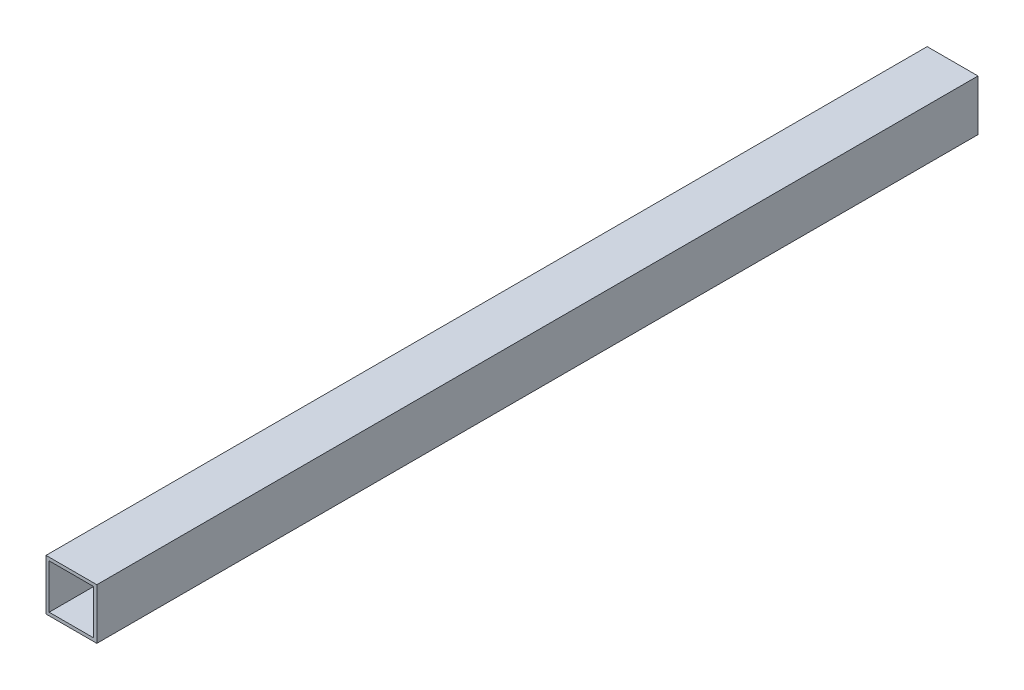
ISO-10303-21;
HEADER;
FILE_DESCRIPTION(('STEP AP214'),'2;1');
FILE_NAME('part.step','',(''),(''),'','','');
FILE_SCHEMA(('AUTOMOTIVE_DESIGN { 1 0 10303 214 1 1 1 1 }'));
ENDSEC;
DATA;
#1=APPLICATION_CONTEXT('core data for automotive mechanical design processes');
#2=APPLICATION_PROTOCOL_DEFINITION('international standard','automotive_design',2000,#1);
#3=PRODUCT_CONTEXT('',#1,'mechanical');
#4=PRODUCT('Part','Part','',(#3));
#5=PRODUCT_RELATED_PRODUCT_CATEGORY('part','',(#4));
#6=PRODUCT_DEFINITION_FORMATION('','',#4);
#7=PRODUCT_DEFINITION_CONTEXT('part definition',#1,'design');
#8=PRODUCT_DEFINITION('design','',#6,#7);
#9=PRODUCT_DEFINITION_SHAPE('','',#8);
#10=(LENGTH_UNIT() NAMED_UNIT(*) SI_UNIT(.MILLI.,.METRE.));
#11=(NAMED_UNIT(*) PLANE_ANGLE_UNIT() SI_UNIT($,.RADIAN.));
#12=(NAMED_UNIT(*) SI_UNIT($,.STERADIAN.) SOLID_ANGLE_UNIT());
#13=UNCERTAINTY_MEASURE_WITH_UNIT(LENGTH_MEASURE(1.E-05),#10,'distance_accuracy_value','');
#14=(GEOMETRIC_REPRESENTATION_CONTEXT(3) GLOBAL_UNCERTAINTY_ASSIGNED_CONTEXT((#13)) GLOBAL_UNIT_ASSIGNED_CONTEXT((#10,
#11,#12)) REPRESENTATION_CONTEXT('',''));
#15=CARTESIAN_POINT('',(0.,0.,0.));
#16=DIRECTION('',(0.,0.,1.));
#17=DIRECTION('',(1.,0.,0.));
#18=AXIS2_PLACEMENT_3D('',#15,#16,#17);
#19=CARTESIAN_POINT('',(38.1,38.1,1320.8));
#20=DIRECTION('',(0.,0.,-1.));
#21=DIRECTION('',(-1.,0.,0.));
#22=AXIS2_PLACEMENT_3D('',#19,#20,#21);
#23=PLANE('',#22);
#24=DIRECTION('',(0.,1.,0.));
#25=VECTOR('',#24,1.);
#26=CARTESIAN_POINT('',(38.1,-38.1,1320.8));
#27=LINE('',#26,#25);
#28=CARTESIAN_POINT('',(38.1,-38.1,1320.8));
#29=VERTEX_POINT('',#28);
#30=CARTESIAN_POINT('',(38.1,38.1,1320.8));
#31=VERTEX_POINT('',#30);
#32=EDGE_CURVE('E154',#29,#31,#27,.T.);
#33=ORIENTED_EDGE('',*,*,#32,.T.);
#34=DIRECTION('',(-1.,0.,0.));
#35=VECTOR('',#34,1.);
#36=CARTESIAN_POINT('',(-38.1,38.1,1320.8));
#37=LINE('',#36,#35);
#38=CARTESIAN_POINT('',(-38.1,38.1,1320.8));
#39=VERTEX_POINT('',#38);
#40=EDGE_CURVE('E157',#31,#39,#37,.T.);
#41=ORIENTED_EDGE('',*,*,#40,.T.);
#42=DIRECTION('',(0.,-1.,0.));
#43=VECTOR('',#42,1.);
#44=CARTESIAN_POINT('',(-38.1,-38.1,1320.8));
#45=LINE('',#44,#43);
#46=CARTESIAN_POINT('',(-38.1,-38.1,1320.8));
#47=VERTEX_POINT('',#46);
#48=EDGE_CURVE('E160',#39,#47,#45,.T.);
#49=ORIENTED_EDGE('',*,*,#48,.T.);
#50=DIRECTION('',(1.,0.,0.));
#51=VECTOR('',#50,1.);
#52=CARTESIAN_POINT('',(-38.1,-38.1,1320.8));
#53=LINE('',#52,#51);
#54=EDGE_CURVE('E162',#47,#29,#53,.T.);
#55=ORIENTED_EDGE('',*,*,#54,.T.);
#56=EDGE_LOOP('',(#33,#41,#49,#55));
#57=FACE_BOUND('',#56,.T.);
#58=DIRECTION('',(0.,1.,0.));
#59=VECTOR('',#58,1.);
#60=CARTESIAN_POINT('',(33.3375,-33.3375,1320.8));
#61=LINE('',#60,#59);
#62=CARTESIAN_POINT('',(33.3375,-33.3375,1320.8));
#63=VERTEX_POINT('',#62);
#64=CARTESIAN_POINT('',(33.3375,33.3375,1320.8));
#65=VERTEX_POINT('',#64);
#66=EDGE_CURVE('E110',#63,#65,#61,.T.);
#67=ORIENTED_EDGE('',*,*,#66,.F.);
#68=DIRECTION('',(1.,0.,0.));
#69=VECTOR('',#68,1.);
#70=CARTESIAN_POINT('',(-33.3375,-33.3375,1320.8));
#71=LINE('',#70,#69);
#72=CARTESIAN_POINT('',(-33.3375,-33.3375,1320.8));
#73=VERTEX_POINT('',#72);
#74=EDGE_CURVE('E133',#73,#63,#71,.T.);
#75=ORIENTED_EDGE('',*,*,#74,.F.);
#76=DIRECTION('',(0.,-1.,0.));
#77=VECTOR('',#76,1.);
#78=CARTESIAN_POINT('',(-33.3375,-33.3375,1320.8));
#79=LINE('',#78,#77);
#80=CARTESIAN_POINT('',(-33.3375,33.3375,1320.8));
#81=VERTEX_POINT('',#80);
#82=EDGE_CURVE('E131',#81,#73,#79,.T.);
#83=ORIENTED_EDGE('',*,*,#82,.F.);
#84=DIRECTION('',(-1.,0.,0.));
#85=VECTOR('',#84,1.);
#86=CARTESIAN_POINT('',(-33.3375,33.3375,1320.8));
#87=LINE('',#86,#85);
#88=EDGE_CURVE('E118',#65,#81,#87,.T.);
#89=ORIENTED_EDGE('',*,*,#88,.F.);
#90=EDGE_LOOP('',(#67,#75,#83,#89));
#91=FACE_BOUND('',#90,.T.);
#92=ADVANCED_FACE('F37',(#57,#91),#23,.F.);
#93=CARTESIAN_POINT('',(38.1,38.1,0.));
#94=DIRECTION('',(0.,0.,-1.));
#95=DIRECTION('',(-1.,0.,0.));
#96=AXIS2_PLACEMENT_3D('',#93,#94,#95);
#97=PLANE('',#96);
#98=DIRECTION('',(0.,1.,0.));
#99=VECTOR('',#98,1.);
#100=CARTESIAN_POINT('',(38.1,-38.1,0.));
#101=LINE('',#100,#99);
#102=CARTESIAN_POINT('',(38.1,-38.1,0.));
#103=VERTEX_POINT('',#102);
#104=CARTESIAN_POINT('',(38.1,38.1,0.));
#105=VERTEX_POINT('',#104);
#106=EDGE_CURVE('E127',#103,#105,#101,.T.);
#107=ORIENTED_EDGE('',*,*,#106,.F.);
#108=DIRECTION('',(1.,0.,0.));
#109=VECTOR('',#108,1.);
#110=CARTESIAN_POINT('',(-38.1,-38.1,0.));
#111=LINE('',#110,#109);
#112=CARTESIAN_POINT('',(-38.1,-38.1,0.));
#113=VERTEX_POINT('',#112);
#114=EDGE_CURVE('E158',#113,#103,#111,.T.);
#115=ORIENTED_EDGE('',*,*,#114,.F.);
#116=DIRECTION('',(0.,-1.,0.));
#117=VECTOR('',#116,1.);
#118=CARTESIAN_POINT('',(-38.1,-38.1,0.));
#119=LINE('',#118,#117);
#120=CARTESIAN_POINT('',(-38.1,38.1,0.));
#121=VERTEX_POINT('',#120);
#122=EDGE_CURVE('E171',#121,#113,#119,.T.);
#123=ORIENTED_EDGE('',*,*,#122,.F.);
#124=DIRECTION('',(-1.,0.,0.));
#125=VECTOR('',#124,1.);
#126=CARTESIAN_POINT('',(-38.1,38.1,0.));
#127=LINE('',#126,#125);
#128=EDGE_CURVE('E168',#105,#121,#127,.T.);
#129=ORIENTED_EDGE('',*,*,#128,.F.);
#130=EDGE_LOOP('',(#107,#115,#123,#129));
#131=FACE_BOUND('',#130,.T.);
#132=DIRECTION('',(1.,0.,0.));
#133=VECTOR('',#132,1.);
#134=CARTESIAN_POINT('',(-33.3375,-33.3375,0.));
#135=LINE('',#134,#133);
#136=CARTESIAN_POINT('',(-33.3375,-33.3375,0.));
#137=VERTEX_POINT('',#136);
#138=CARTESIAN_POINT('',(33.3375,-33.3375,0.));
#139=VERTEX_POINT('',#138);
#140=EDGE_CURVE('E119',#137,#139,#135,.T.);
#141=ORIENTED_EDGE('',*,*,#140,.T.);
#142=DIRECTION('',(0.,1.,0.));
#143=VECTOR('',#142,1.);
#144=CARTESIAN_POINT('',(33.3375,-33.3375,0.));
#145=LINE('',#144,#143);
#146=CARTESIAN_POINT('',(33.3375,33.3375,0.));
#147=VERTEX_POINT('',#146);
#148=EDGE_CURVE('E64',#139,#147,#145,.T.);
#149=ORIENTED_EDGE('',*,*,#148,.T.);
#150=DIRECTION('',(-1.,0.,0.));
#151=VECTOR('',#150,1.);
#152=CARTESIAN_POINT('',(-33.3375,33.3375,0.));
#153=LINE('',#152,#151);
#154=CARTESIAN_POINT('',(-33.3375,33.3375,0.));
#155=VERTEX_POINT('',#154);
#156=EDGE_CURVE('E125',#147,#155,#153,.T.);
#157=ORIENTED_EDGE('',*,*,#156,.T.);
#158=DIRECTION('',(0.,-1.,0.));
#159=VECTOR('',#158,1.);
#160=CARTESIAN_POINT('',(-33.3375,-33.3375,0.));
#161=LINE('',#160,#159);
#162=EDGE_CURVE('E141',#155,#137,#161,.T.);
#163=ORIENTED_EDGE('',*,*,#162,.T.);
#164=EDGE_LOOP('',(#141,#149,#157,#163));
#165=FACE_BOUND('',#164,.T.);
#166=ADVANCED_FACE('F193',(#131,#165),#97,.T.);
#167=CARTESIAN_POINT('',(38.1,-38.1,1320.8));
#168=DIRECTION('',(-1.,0.,0.));
#169=DIRECTION('',(0.,0.,1.));
#170=AXIS2_PLACEMENT_3D('',#167,#168,#169);
#171=PLANE('',#170);
#172=ORIENTED_EDGE('',*,*,#106,.T.);
#173=DIRECTION('',(0.,0.,-1.));
#174=VECTOR('',#173,1.);
#175=CARTESIAN_POINT('',(38.1,38.1,1320.8));
#176=LINE('',#175,#174);
#177=EDGE_CURVE('E11',#31,#105,#176,.T.);
#178=ORIENTED_EDGE('',*,*,#177,.F.);
#179=ORIENTED_EDGE('',*,*,#32,.F.);
#180=DIRECTION('',(0.,0.,-1.));
#181=VECTOR('',#180,1.);
#182=CARTESIAN_POINT('',(38.1,-38.1,1320.8));
#183=LINE('',#182,#181);
#184=EDGE_CURVE('E164',#29,#103,#183,.T.);
#185=ORIENTED_EDGE('',*,*,#184,.T.);
#186=EDGE_LOOP('',(#172,#178,#179,#185));
#187=FACE_BOUND('',#186,.T.);
#188=ADVANCED_FACE('F39',(#187),#171,.F.);
#189=CARTESIAN_POINT('',(-38.1,38.1,1320.8));
#190=DIRECTION('',(0.,-1.,0.));
#191=DIRECTION('',(0.,0.,-1.));
#192=AXIS2_PLACEMENT_3D('',#189,#190,#191);
#193=PLANE('',#192);
#194=ORIENTED_EDGE('',*,*,#128,.T.);
#195=DIRECTION('',(0.,0.,-1.));
#196=VECTOR('',#195,1.);
#197=CARTESIAN_POINT('',(-38.1,38.1,1320.8));
#198=LINE('',#197,#196);
#199=EDGE_CURVE('E46',#39,#121,#198,.T.);
#200=ORIENTED_EDGE('',*,*,#199,.F.);
#201=ORIENTED_EDGE('',*,*,#40,.F.);
#202=ORIENTED_EDGE('',*,*,#177,.T.);
#203=EDGE_LOOP('',(#194,#200,#201,#202));
#204=FACE_BOUND('',#203,.T.);
#205=ADVANCED_FACE('F203',(#204),#193,.F.);
#206=CARTESIAN_POINT('',(-38.1,-38.1,1320.8));
#207=DIRECTION('',(1.,0.,0.));
#208=DIRECTION('',(0.,0.,-1.));
#209=AXIS2_PLACEMENT_3D('',#206,#207,#208);
#210=PLANE('',#209);
#211=ORIENTED_EDGE('',*,*,#122,.T.);
#212=DIRECTION('',(0.,0.,-1.));
#213=VECTOR('',#212,1.);
#214=CARTESIAN_POINT('',(-38.1,-38.1,1320.8));
#215=LINE('',#214,#213);
#216=EDGE_CURVE('E179',#47,#113,#215,.T.);
#217=ORIENTED_EDGE('',*,*,#216,.F.);
#218=ORIENTED_EDGE('',*,*,#48,.F.);
#219=ORIENTED_EDGE('',*,*,#199,.T.);
#220=EDGE_LOOP('',(#211,#217,#218,#219));
#221=FACE_BOUND('',#220,.T.);
#222=ADVANCED_FACE('F187',(#221),#210,.F.);
#223=CARTESIAN_POINT('',(-38.1,-38.1,1320.8));
#224=DIRECTION('',(0.,1.,0.));
#225=DIRECTION('',(0.,0.,1.));
#226=AXIS2_PLACEMENT_3D('',#223,#224,#225);
#227=PLANE('',#226);
#228=ORIENTED_EDGE('',*,*,#114,.T.);
#229=ORIENTED_EDGE('',*,*,#184,.F.);
#230=ORIENTED_EDGE('',*,*,#54,.F.);
#231=ORIENTED_EDGE('',*,*,#216,.T.);
#232=EDGE_LOOP('',(#228,#229,#230,#231));
#233=FACE_BOUND('',#232,.T.);
#234=ADVANCED_FACE('F197',(#233),#227,.F.);
#235=CARTESIAN_POINT('',(33.3375,-33.3375,1320.8));
#236=DIRECTION('',(-1.,0.,0.));
#237=DIRECTION('',(0.,0.,1.));
#238=AXIS2_PLACEMENT_3D('',#235,#236,#237);
#239=PLANE('',#238);
#240=ORIENTED_EDGE('',*,*,#148,.F.);
#241=DIRECTION('',(0.,0.,-1.));
#242=VECTOR('',#241,1.);
#243=CARTESIAN_POINT('',(33.3375,-33.3375,1320.8));
#244=LINE('',#243,#242);
#245=EDGE_CURVE('E114',#63,#139,#244,.T.);
#246=ORIENTED_EDGE('',*,*,#245,.F.);
#247=ORIENTED_EDGE('',*,*,#66,.T.);
#248=DIRECTION('',(0.,0.,-1.));
#249=VECTOR('',#248,1.);
#250=CARTESIAN_POINT('',(33.3375,33.3375,1320.8));
#251=LINE('',#250,#249);
#252=EDGE_CURVE('E113',#65,#147,#251,.T.);
#253=ORIENTED_EDGE('',*,*,#252,.T.);
#254=EDGE_LOOP('',(#240,#246,#247,#253));
#255=FACE_BOUND('',#254,.T.);
#256=ADVANCED_FACE('F112',(#255),#239,.T.);
#257=CARTESIAN_POINT('',(-33.3375,33.3375,1320.8));
#258=DIRECTION('',(0.,-1.,0.));
#259=DIRECTION('',(1.,0.,0.));
#260=AXIS2_PLACEMENT_3D('',#257,#258,#259);
#261=PLANE('',#260);
#262=ORIENTED_EDGE('',*,*,#156,.F.);
#263=ORIENTED_EDGE('',*,*,#252,.F.);
#264=ORIENTED_EDGE('',*,*,#88,.T.);
#265=DIRECTION('',(0.,0.,-1.));
#266=VECTOR('',#265,1.);
#267=CARTESIAN_POINT('',(-33.3375,33.3375,1320.8));
#268=LINE('',#267,#266);
#269=EDGE_CURVE('E128',#81,#155,#268,.T.);
#270=ORIENTED_EDGE('',*,*,#269,.T.);
#271=EDGE_LOOP('',(#262,#263,#264,#270));
#272=FACE_BOUND('',#271,.T.);
#273=ADVANCED_FACE('F122',(#272),#261,.T.);
#274=CARTESIAN_POINT('',(-33.3375,-33.3375,1320.8));
#275=DIRECTION('',(1.,0.,0.));
#276=DIRECTION('',(0.,0.,-1.));
#277=AXIS2_PLACEMENT_3D('',#274,#275,#276);
#278=PLANE('',#277);
#279=ORIENTED_EDGE('',*,*,#162,.F.);
#280=ORIENTED_EDGE('',*,*,#269,.F.);
#281=ORIENTED_EDGE('',*,*,#82,.T.);
#282=DIRECTION('',(0.,0.,-1.));
#283=VECTOR('',#282,1.);
#284=CARTESIAN_POINT('',(-33.3375,-33.3375,1320.8));
#285=LINE('',#284,#283);
#286=EDGE_CURVE('E53',#73,#137,#285,.T.);
#287=ORIENTED_EDGE('',*,*,#286,.T.);
#288=EDGE_LOOP('',(#279,#280,#281,#287));
#289=FACE_BOUND('',#288,.T.);
#290=ADVANCED_FACE('F226',(#289),#278,.T.);
#291=CARTESIAN_POINT('',(-33.3375,-33.3375,1320.8));
#292=DIRECTION('',(0.,1.,0.));
#293=DIRECTION('',(0.,0.,1.));
#294=AXIS2_PLACEMENT_3D('',#291,#292,#293);
#295=PLANE('',#294);
#296=ORIENTED_EDGE('',*,*,#140,.F.);
#297=ORIENTED_EDGE('',*,*,#286,.F.);
#298=ORIENTED_EDGE('',*,*,#74,.T.);
#299=ORIENTED_EDGE('',*,*,#245,.T.);
#300=EDGE_LOOP('',(#296,#297,#298,#299));
#301=FACE_BOUND('',#300,.T.);
#302=ADVANCED_FACE('F230',(#301),#295,.T.);
#303=CLOSED_SHELL('',(#92,#166,#188,#205,#222,#234,#256,#273,#290,#302));
#304=MANIFOLD_SOLID_BREP('B2',#303);
#305=ADVANCED_BREP_SHAPE_REPRESENTATION('',(#18,#304),#14);
#306=SHAPE_DEFINITION_REPRESENTATION(#9,#305);
ENDSEC;
END-ISO-10303-21;
